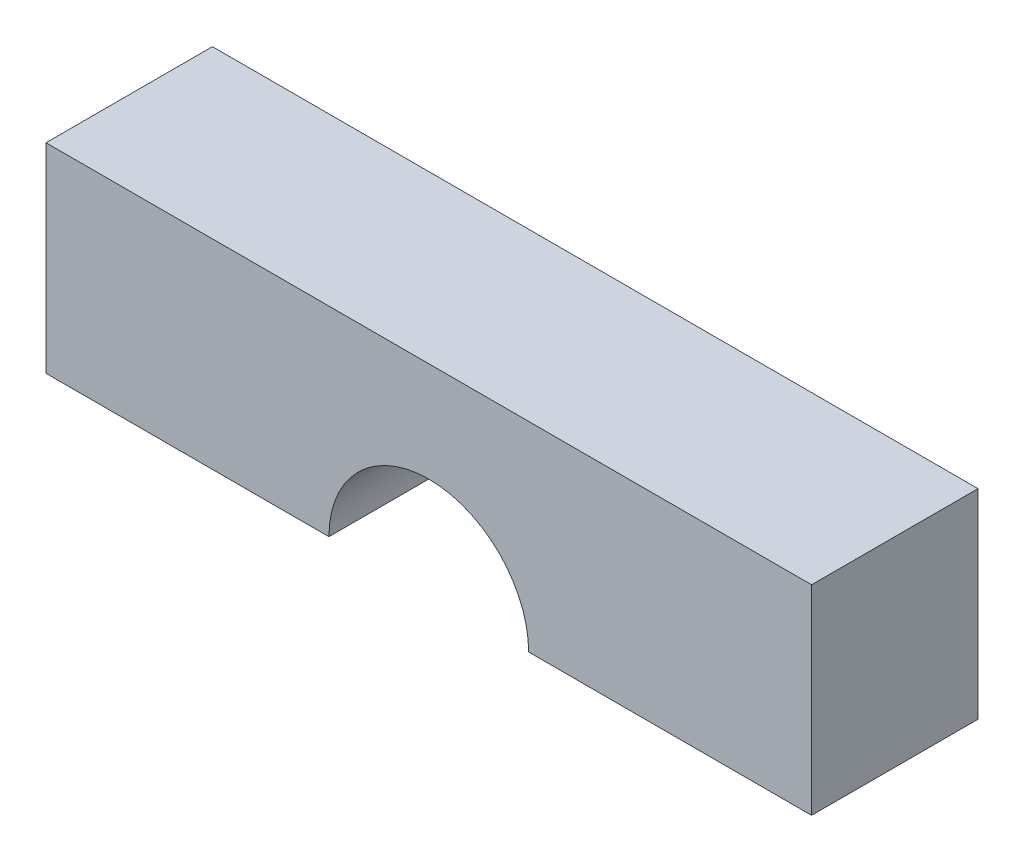
ISO-10303-21;
HEADER;
FILE_DESCRIPTION(('STEP AP214'),'2;1');
FILE_NAME('part.step','',(''),(''),'','','');
FILE_SCHEMA(('AUTOMOTIVE_DESIGN { 1 0 10303 214 1 1 1 1 }'));
ENDSEC;
DATA;
#1=APPLICATION_CONTEXT('core data for automotive mechanical design processes');
#2=APPLICATION_PROTOCOL_DEFINITION('international standard','automotive_design',2000,#1);
#3=PRODUCT_CONTEXT('',#1,'mechanical');
#4=PRODUCT('Part','Part','',(#3));
#5=PRODUCT_RELATED_PRODUCT_CATEGORY('part','',(#4));
#6=PRODUCT_DEFINITION_FORMATION('','',#4);
#7=PRODUCT_DEFINITION_CONTEXT('part definition',#1,'design');
#8=PRODUCT_DEFINITION('design','',#6,#7);
#9=PRODUCT_DEFINITION_SHAPE('','',#8);
#10=(LENGTH_UNIT() NAMED_UNIT(*) SI_UNIT(.MILLI.,.METRE.));
#11=(NAMED_UNIT(*) PLANE_ANGLE_UNIT() SI_UNIT($,.RADIAN.));
#12=(NAMED_UNIT(*) SI_UNIT($,.STERADIAN.) SOLID_ANGLE_UNIT());
#13=UNCERTAINTY_MEASURE_WITH_UNIT(LENGTH_MEASURE(1.E-05),#10,'distance_accuracy_value','');
#14=(GEOMETRIC_REPRESENTATION_CONTEXT(3) GLOBAL_UNCERTAINTY_ASSIGNED_CONTEXT((#13)) GLOBAL_UNIT_ASSIGNED_CONTEXT((#10,
#11,#12)) REPRESENTATION_CONTEXT('',''));
#15=CARTESIAN_POINT('',(0.,0.,0.));
#16=DIRECTION('',(0.,0.,1.));
#17=DIRECTION('',(1.,0.,0.));
#18=AXIS2_PLACEMENT_3D('',#15,#16,#17);
#19=CARTESIAN_POINT('',(23.,18.,13.51));
#20=DIRECTION('',(0.,-1.,0.));
#21=DIRECTION('',(0.,0.,-1.));
#22=AXIS2_PLACEMENT_3D('',#19,#20,#21);
#23=PLANE('',#22);
#24=DIRECTION('',(1.,0.,0.));
#25=VECTOR('',#24,1.);
#26=CARTESIAN_POINT('',(23.,18.,-13.5));
#27=LINE('',#26,#25);
#28=CARTESIAN_POINT('',(-23.,18.,-13.5));
#29=VERTEX_POINT('',#28);
#30=CARTESIAN_POINT('',(-6.,18.,-13.5));
#31=VERTEX_POINT('',#30);
#32=EDGE_CURVE('E89',#29,#31,#27,.T.);
#33=ORIENTED_EDGE('',*,*,#32,.F.);
#34=DIRECTION('',(0.,0.,-1.));
#35=VECTOR('',#34,1.);
#36=CARTESIAN_POINT('',(-23.,18.,13.51));
#37=LINE('',#36,#35);
#38=CARTESIAN_POINT('',(-23.,18.,-23.5));
#39=VERTEX_POINT('',#38);
#40=EDGE_CURVE('E131',#29,#39,#37,.T.);
#41=ORIENTED_EDGE('',*,*,#40,.T.);
#42=DIRECTION('',(-1.,0.,0.));
#43=VECTOR('',#42,1.);
#44=CARTESIAN_POINT('',(23.,18.,-23.5));
#45=LINE('',#44,#43);
#46=CARTESIAN_POINT('',(-6.,18.,-23.5));
#47=VERTEX_POINT('',#46);
#48=EDGE_CURVE('E113',#47,#39,#45,.T.);
#49=ORIENTED_EDGE('',*,*,#48,.F.);
#50=DIRECTION('',(0.,0.,-1.));
#51=VECTOR('',#50,1.);
#52=CARTESIAN_POINT('',(-6.,18.,6.49999999999999));
#53=LINE('',#52,#51);
#54=EDGE_CURVE('E104',#47,#31,#53,.F.);
#55=ORIENTED_EDGE('',*,*,#54,.T.);
#56=EDGE_LOOP('',(#33,#41,#49,#55));
#57=FACE_BOUND('',#56,.T.);
#58=ADVANCED_FACE('F32',(#57),#23,.T.);
#59=CARTESIAN_POINT('',(6.,18.,-13.5));
#60=VERTEX_POINT('',#59);
#61=CARTESIAN_POINT('',(23.,18.,-13.5));
#62=VERTEX_POINT('',#61);
#63=EDGE_CURVE('E87',#60,#62,#27,.T.);
#64=ORIENTED_EDGE('',*,*,#63,.F.);
#65=DIRECTION('',(0.,0.,-1.));
#66=VECTOR('',#65,1.);
#67=CARTESIAN_POINT('',(6.,18.,6.49999999999999));
#68=LINE('',#67,#66);
#69=CARTESIAN_POINT('',(6.,18.,-23.5));
#70=VERTEX_POINT('',#69);
#71=EDGE_CURVE('E98',#60,#70,#68,.T.);
#72=ORIENTED_EDGE('',*,*,#71,.T.);
#73=CARTESIAN_POINT('',(23.,18.,-23.5));
#74=VERTEX_POINT('',#73);
#75=EDGE_CURVE('E101',#74,#70,#45,.T.);
#76=ORIENTED_EDGE('',*,*,#75,.F.);
#77=DIRECTION('',(0.,0.,1.));
#78=VECTOR('',#77,1.);
#79=CARTESIAN_POINT('',(23.,18.,-13.5));
#80=LINE('',#79,#78);
#81=EDGE_CURVE('E100',#74,#62,#80,.T.);
#82=ORIENTED_EDGE('',*,*,#81,.T.);
#83=EDGE_LOOP('',(#64,#72,#76,#82));
#84=FACE_BOUND('',#83,.T.);
#85=ADVANCED_FACE('F97',(#84),#23,.T.);
#86=CARTESIAN_POINT('',(0.,30.,0.));
#87=DIRECTION('',(0.,-1.,0.));
#88=DIRECTION('',(0.,0.,-1.));
#89=AXIS2_PLACEMENT_3D('',#86,#87,#88);
#90=PLANE('',#89);
#91=DIRECTION('',(0.,0.,1.));
#92=VECTOR('',#91,1.);
#93=CARTESIAN_POINT('',(23.,30.,-23.5));
#94=LINE('',#93,#92);
#95=CARTESIAN_POINT('',(23.,30.,-23.5));
#96=VERTEX_POINT('',#95);
#97=CARTESIAN_POINT('',(23.,30.,-13.5));
#98=VERTEX_POINT('',#97);
#99=EDGE_CURVE('E94',#96,#98,#94,.T.);
#100=ORIENTED_EDGE('',*,*,#99,.F.);
#101=DIRECTION('',(1.,0.,0.));
#102=VECTOR('',#101,1.);
#103=CARTESIAN_POINT('',(23.,30.,-23.5));
#104=LINE('',#103,#102);
#105=CARTESIAN_POINT('',(-23.,30.,-23.5));
#106=VERTEX_POINT('',#105);
#107=EDGE_CURVE('E117',#106,#96,#104,.T.);
#108=ORIENTED_EDGE('',*,*,#107,.F.);
#109=DIRECTION('',(0.,0.,-1.));
#110=VECTOR('',#109,1.);
#111=CARTESIAN_POINT('',(-23.,30.,-23.5));
#112=LINE('',#111,#110);
#113=CARTESIAN_POINT('',(-23.,30.,-13.5));
#114=VERTEX_POINT('',#113);
#115=EDGE_CURVE('E121',#114,#106,#112,.T.);
#116=ORIENTED_EDGE('',*,*,#115,.F.);
#117=DIRECTION('',(-1.,0.,0.));
#118=VECTOR('',#117,1.);
#119=CARTESIAN_POINT('',(23.,30.,-13.5));
#120=LINE('',#119,#118);
#121=EDGE_CURVE('E125',#98,#114,#120,.T.);
#122=ORIENTED_EDGE('',*,*,#121,.F.);
#123=EDGE_LOOP('',(#100,#108,#116,#122));
#124=FACE_BOUND('',#123,.T.);
#125=ADVANCED_FACE('F140',(#124),#90,.F.);
#126=CARTESIAN_POINT('',(-23.,10.,-13.5));
#127=DIRECTION('',(1.,0.,0.));
#128=DIRECTION('',(0.,0.,-1.));
#129=AXIS2_PLACEMENT_3D('',#126,#127,#128);
#130=PLANE('',#129);
#131=ORIENTED_EDGE('',*,*,#40,.F.);
#132=DIRECTION('',(0.,-1.,0.));
#133=VECTOR('',#132,1.);
#134=CARTESIAN_POINT('',(-23.,30.,-13.5));
#135=LINE('',#134,#133);
#136=EDGE_CURVE('E55',#114,#29,#135,.T.);
#137=ORIENTED_EDGE('',*,*,#136,.F.);
#138=ORIENTED_EDGE('',*,*,#115,.T.);
#139=DIRECTION('',(0.,-1.,0.));
#140=VECTOR('',#139,1.);
#141=CARTESIAN_POINT('',(-23.,30.,-23.5));
#142=LINE('',#141,#140);
#143=EDGE_CURVE('E112',#106,#39,#142,.T.);
#144=ORIENTED_EDGE('',*,*,#143,.T.);
#145=EDGE_LOOP('',(#131,#137,#138,#144));
#146=FACE_BOUND('',#145,.T.);
#147=ADVANCED_FACE('F135',(#146),#130,.F.);
#148=CARTESIAN_POINT('',(23.,10.,-13.5));
#149=DIRECTION('',(-1.,0.,0.));
#150=DIRECTION('',(0.,0.,1.));
#151=AXIS2_PLACEMENT_3D('',#148,#149,#150);
#152=PLANE('',#151);
#153=ORIENTED_EDGE('',*,*,#81,.F.);
#154=DIRECTION('',(0.,-1.,0.));
#155=VECTOR('',#154,1.);
#156=CARTESIAN_POINT('',(23.,30.,-23.5));
#157=LINE('',#156,#155);
#158=EDGE_CURVE('E109',#96,#74,#157,.T.);
#159=ORIENTED_EDGE('',*,*,#158,.F.);
#160=ORIENTED_EDGE('',*,*,#99,.T.);
#161=DIRECTION('',(0.,-1.,0.));
#162=VECTOR('',#161,1.);
#163=CARTESIAN_POINT('',(23.,30.,-13.5));
#164=LINE('',#163,#162);
#165=EDGE_CURVE('E47',#98,#62,#164,.T.);
#166=ORIENTED_EDGE('',*,*,#165,.T.);
#167=EDGE_LOOP('',(#153,#159,#160,#166));
#168=FACE_BOUND('',#167,.T.);
#169=ADVANCED_FACE('F137',(#168),#152,.F.);
#170=CARTESIAN_POINT('',(23.,30.,-13.5));
#171=DIRECTION('',(0.,0.,1.));
#172=DIRECTION('',(1.,0.,0.));
#173=AXIS2_PLACEMENT_3D('',#170,#171,#172);
#174=PLANE('',#173);
#175=ORIENTED_EDGE('',*,*,#136,.T.);
#176=ORIENTED_EDGE('',*,*,#32,.T.);
#177=CARTESIAN_POINT('',(0.,18.,-13.5));
#178=DIRECTION('',(0.,0.,1.));
#179=DIRECTION('',(1.,0.,0.));
#180=AXIS2_PLACEMENT_3D('',#177,#178,#179);
#181=CIRCLE('',#180,6.);
#182=EDGE_CURVE('E40',#60,#31,#181,.T.);
#183=ORIENTED_EDGE('',*,*,#182,.F.);
#184=ORIENTED_EDGE('',*,*,#63,.T.);
#185=ORIENTED_EDGE('',*,*,#165,.F.);
#186=ORIENTED_EDGE('',*,*,#121,.T.);
#187=EDGE_LOOP('',(#175,#176,#183,#184,#185,#186));
#188=FACE_BOUND('',#187,.T.);
#189=ADVANCED_FACE('F86',(#188),#174,.T.);
#190=CARTESIAN_POINT('',(23.,30.,-23.5));
#191=DIRECTION('',(0.,0.,-1.));
#192=DIRECTION('',(-1.,0.,0.));
#193=AXIS2_PLACEMENT_3D('',#190,#191,#192);
#194=PLANE('',#193);
#195=ORIENTED_EDGE('',*,*,#158,.T.);
#196=ORIENTED_EDGE('',*,*,#75,.T.);
#197=CARTESIAN_POINT('',(0.,18.,-23.5));
#198=DIRECTION('',(0.,0.,-1.));
#199=DIRECTION('',(-1.,0.,0.));
#200=AXIS2_PLACEMENT_3D('',#197,#198,#199);
#201=CIRCLE('',#200,6.);
#202=EDGE_CURVE('E11',#47,#70,#201,.T.);
#203=ORIENTED_EDGE('',*,*,#202,.F.);
#204=ORIENTED_EDGE('',*,*,#48,.T.);
#205=ORIENTED_EDGE('',*,*,#143,.F.);
#206=ORIENTED_EDGE('',*,*,#107,.T.);
#207=EDGE_LOOP('',(#195,#196,#203,#204,#205,#206));
#208=FACE_BOUND('',#207,.T.);
#209=ADVANCED_FACE('F136',(#208),#194,.T.);
#210=CARTESIAN_POINT('',(0.,18.,6.49999999999999));
#211=DIRECTION('',(0.,0.,-1.));
#212=DIRECTION('',(-1.,0.,0.));
#213=AXIS2_PLACEMENT_3D('',#210,#211,#212);
#214=CYLINDRICAL_SURFACE('',#213,6.);
#215=ORIENTED_EDGE('',*,*,#54,.F.);
#216=ORIENTED_EDGE('',*,*,#202,.T.);
#217=ORIENTED_EDGE('',*,*,#71,.F.);
#218=ORIENTED_EDGE('',*,*,#182,.T.);
#219=EDGE_LOOP('',(#215,#216,#217,#218));
#220=FACE_BOUND('',#219,.T.);
#221=ADVANCED_FACE('F34',(#220),#214,.F.);
#222=CLOSED_SHELL('',(#58,#85,#125,#147,#169,#189,#209,#221));
#223=MANIFOLD_SOLID_BREP('B2',#222);
#224=ADVANCED_BREP_SHAPE_REPRESENTATION('',(#18,#223),#14);
#225=SHAPE_DEFINITION_REPRESENTATION(#9,#224);
ENDSEC;
END-ISO-10303-21;
